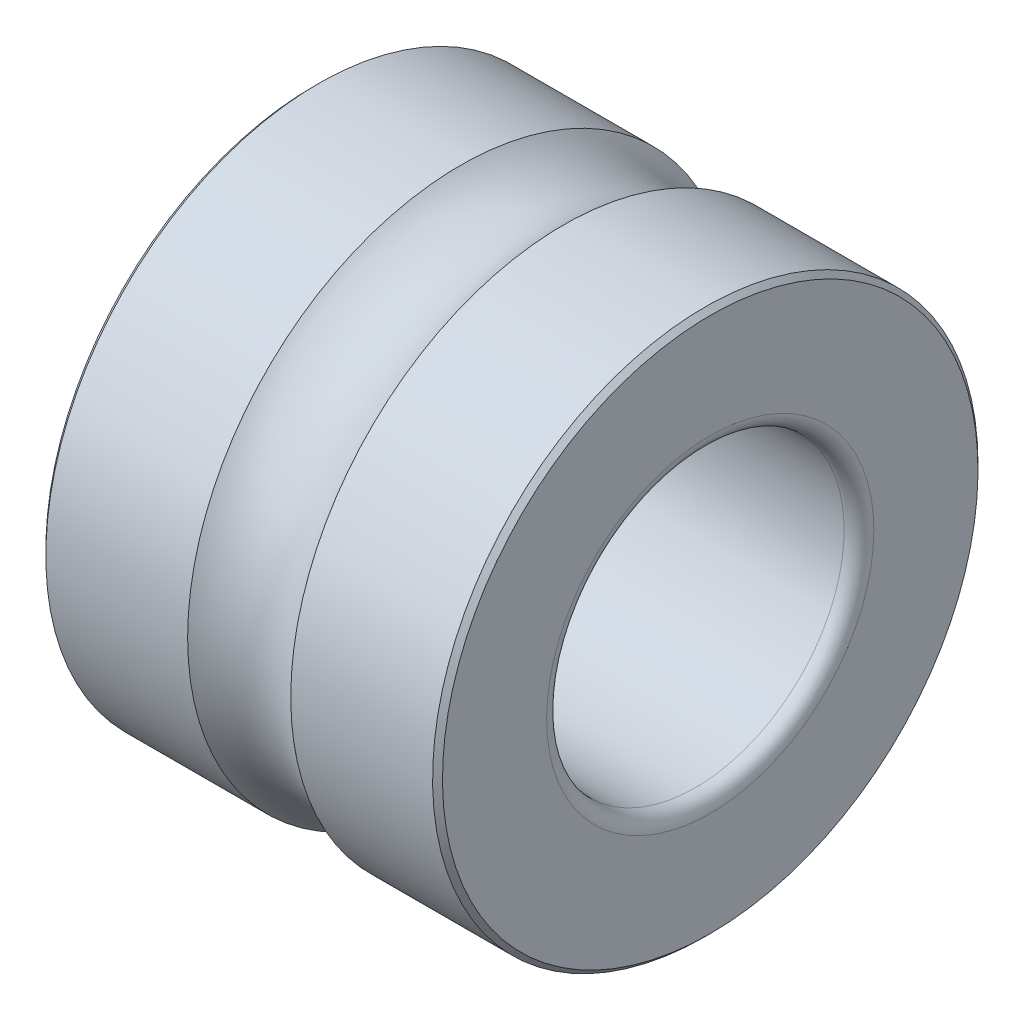
ISO-10303-21;
HEADER;
FILE_DESCRIPTION(('STEP AP214'),'2;1');
FILE_NAME('part.step','',(''),(''),'','','');
FILE_SCHEMA(('AUTOMOTIVE_DESIGN { 1 0 10303 214 1 1 1 1 }'));
ENDSEC;
DATA;
#1=APPLICATION_CONTEXT('core data for automotive mechanical design processes');
#2=APPLICATION_PROTOCOL_DEFINITION('international standard','automotive_design',2000,#1);
#3=PRODUCT_CONTEXT('',#1,'mechanical');
#4=PRODUCT('Part','Part','',(#3));
#5=PRODUCT_RELATED_PRODUCT_CATEGORY('part','',(#4));
#6=PRODUCT_DEFINITION_FORMATION('','',#4);
#7=PRODUCT_DEFINITION_CONTEXT('part definition',#1,'design');
#8=PRODUCT_DEFINITION('design','',#6,#7);
#9=PRODUCT_DEFINITION_SHAPE('','',#8);
#10=(LENGTH_UNIT() NAMED_UNIT(*) SI_UNIT(.MILLI.,.METRE.));
#11=(NAMED_UNIT(*) PLANE_ANGLE_UNIT() SI_UNIT($,.RADIAN.));
#12=(NAMED_UNIT(*) SI_UNIT($,.STERADIAN.) SOLID_ANGLE_UNIT());
#13=UNCERTAINTY_MEASURE_WITH_UNIT(LENGTH_MEASURE(1.E-05),#10,'distance_accuracy_value','');
#14=(GEOMETRIC_REPRESENTATION_CONTEXT(3) GLOBAL_UNCERTAINTY_ASSIGNED_CONTEXT((#13)) GLOBAL_UNIT_ASSIGNED_CONTEXT((#10,
#11,#12)) REPRESENTATION_CONTEXT('',''));
#15=CARTESIAN_POINT('',(0.,0.,0.));
#16=DIRECTION('',(0.,0.,1.));
#17=DIRECTION('',(1.,0.,0.));
#18=AXIS2_PLACEMENT_3D('',#15,#16,#17);
#19=CARTESIAN_POINT('',(-2.,0.,0.));
#20=DIRECTION('',(1.,0.,0.));
#21=DIRECTION('',(0.,0.,-1.));
#22=AXIS2_PLACEMENT_3D('',#19,#20,#21);
#23=CYLINDRICAL_SURFACE('',#22,1.5);
#24=CARTESIAN_POINT('',(-1.85,0.,0.));
#25=DIRECTION('',(-1.,0.,0.));
#26=DIRECTION('',(0.,0.,1.));
#27=AXIS2_PLACEMENT_3D('',#24,#25,#26);
#28=CIRCLE('',#27,1.5);
#29=CARTESIAN_POINT('',(-1.85,0.,1.5));
#30=VERTEX_POINT('',#29);
#31=EDGE_CURVE('E80',#30,#30,#28,.F.);
#32=ORIENTED_EDGE('',*,*,#31,.F.);
#33=EDGE_LOOP('',(#32));
#34=FACE_BOUND('',#33,.T.);
#35=CARTESIAN_POINT('',(1.85,0.,0.));
#36=DIRECTION('',(-1.,0.,0.));
#37=DIRECTION('',(0.,0.,1.));
#38=AXIS2_PLACEMENT_3D('',#35,#36,#37);
#39=CIRCLE('',#38,1.5);
#40=CARTESIAN_POINT('',(1.85,0.,1.5));
#41=VERTEX_POINT('',#40);
#42=EDGE_CURVE('E76',#41,#41,#39,.T.);
#43=ORIENTED_EDGE('',*,*,#42,.F.);
#44=EDGE_LOOP('',(#43));
#45=FACE_BOUND('',#44,.T.);
#46=ADVANCED_FACE('F14',(#34,#45),#23,.F.);
#47=CARTESIAN_POINT('',(-1.85,0.,0.));
#48=DIRECTION('',(-1.,0.,0.));
#49=DIRECTION('',(0.,0.,1.));
#50=AXIS2_PLACEMENT_3D('',#47,#48,#49);
#51=TOROIDAL_SURFACE('',#50,1.65,0.15);
#52=ORIENTED_EDGE('',*,*,#31,.T.);
#53=EDGE_LOOP('',(#52));
#54=FACE_BOUND('',#53,.T.);
#55=CARTESIAN_POINT('',(-2.,0.,0.));
#56=DIRECTION('',(-1.,0.,0.));
#57=DIRECTION('',(0.,0.,-1.));
#58=AXIS2_PLACEMENT_3D('',#55,#56,#57);
#59=CIRCLE('',#58,1.65);
#60=CARTESIAN_POINT('',(-2.,0.,-1.65));
#61=VERTEX_POINT('',#60);
#62=EDGE_CURVE('E79',#61,#61,#59,.T.);
#63=ORIENTED_EDGE('',*,*,#62,.T.);
#64=EDGE_LOOP('',(#63));
#65=FACE_BOUND('',#64,.T.);
#66=ADVANCED_FACE('F94',(#54,#65),#51,.T.);
#67=CARTESIAN_POINT('',(1.85,0.,0.));
#68=DIRECTION('',(-1.,0.,0.));
#69=DIRECTION('',(0.,0.,1.));
#70=AXIS2_PLACEMENT_3D('',#67,#68,#69);
#71=TOROIDAL_SURFACE('',#70,1.65,0.15);
#72=CARTESIAN_POINT('',(2.,0.,0.));
#73=DIRECTION('',(1.,0.,0.));
#74=DIRECTION('',(0.,0.,1.));
#75=AXIS2_PLACEMENT_3D('',#72,#73,#74);
#76=CIRCLE('',#75,1.65);
#77=CARTESIAN_POINT('',(2.,0.,1.65));
#78=VERTEX_POINT('',#77);
#79=EDGE_CURVE('E35',#78,#78,#76,.T.);
#80=ORIENTED_EDGE('',*,*,#79,.T.);
#81=EDGE_LOOP('',(#80));
#82=FACE_BOUND('',#81,.T.);
#83=ORIENTED_EDGE('',*,*,#42,.T.);
#84=EDGE_LOOP('',(#83));
#85=FACE_BOUND('',#84,.T.);
#86=ADVANCED_FACE('F57',(#82,#85),#71,.T.);
#87=CARTESIAN_POINT('',(-2.,1.65,0.));
#88=DIRECTION('',(1.,0.,0.));
#89=DIRECTION('',(0.,0.,-1.));
#90=AXIS2_PLACEMENT_3D('',#87,#88,#89);
#91=PLANE('',#90);
#92=ORIENTED_EDGE('',*,*,#62,.F.);
#93=EDGE_LOOP('',(#92));
#94=FACE_BOUND('',#93,.T.);
#95=CARTESIAN_POINT('',(-1.99999999995271,0.,0.));
#96=DIRECTION('',(1.,0.,0.));
#97=DIRECTION('',(0.,0.,-1.));
#98=AXIS2_PLACEMENT_3D('',#95,#96,#97);
#99=CIRCLE('',#98,2.70000000006121);
#100=CARTESIAN_POINT('',(-1.99999999995271,0.,-2.70000000006121));
#101=VERTEX_POINT('',#100);
#102=EDGE_CURVE('E17',#101,#101,#99,.T.);
#103=ORIENTED_EDGE('',*,*,#102,.F.);
#104=EDGE_LOOP('',(#103));
#105=FACE_BOUND('',#104,.T.);
#106=ADVANCED_FACE('F52',(#94,#105),#91,.F.);
#107=CARTESIAN_POINT('',(2.,2.7,0.));
#108=DIRECTION('',(-1.,0.,0.));
#109=DIRECTION('',(0.,0.,1.));
#110=AXIS2_PLACEMENT_3D('',#107,#108,#109);
#111=PLANE('',#110);
#112=ORIENTED_EDGE('',*,*,#79,.F.);
#113=EDGE_LOOP('',(#112));
#114=FACE_BOUND('',#113,.T.);
#115=CARTESIAN_POINT('',(2.00000000006639,0.,0.));
#116=DIRECTION('',(-1.,0.,0.));
#117=DIRECTION('',(0.,-1.,0.));
#118=AXIS2_PLACEMENT_3D('',#115,#116,#117);
#119=CIRCLE('',#118,2.70000000000437);
#120=CARTESIAN_POINT('',(2.00000000006639,-2.70000000000437,0.));
#121=VERTEX_POINT('',#120);
#122=EDGE_CURVE('E73',#121,#121,#119,.T.);
#123=ORIENTED_EDGE('',*,*,#122,.F.);
#124=EDGE_LOOP('',(#123));
#125=FACE_BOUND('',#124,.T.);
#126=ADVANCED_FACE('F41',(#114,#125),#111,.F.);
#127=CARTESIAN_POINT('',(-1.9500000000221,0.,0.));
#128=DIRECTION('',(1.,0.,0.));
#129=DIRECTION('',(0.,0.,-1.));
#130=AXIS2_PLACEMENT_3D('',#127,#128,#129);
#131=CONICAL_SURFACE('',#130,2.74999999999181,0.785398163397448);
#132=CARTESIAN_POINT('',(-1.95,0.,0.));
#133=DIRECTION('',(1.,0.,0.));
#134=DIRECTION('',(0.,0.,-1.));
#135=AXIS2_PLACEMENT_3D('',#132,#133,#134);
#136=CIRCLE('',#135,2.75);
#137=CARTESIAN_POINT('',(-1.95,0.,-2.75));
#138=VERTEX_POINT('',#137);
#139=EDGE_CURVE('E66',#138,#138,#136,.T.);
#140=ORIENTED_EDGE('',*,*,#139,.F.);
#141=EDGE_LOOP('',(#140));
#142=FACE_BOUND('',#141,.T.);
#143=ORIENTED_EDGE('',*,*,#102,.T.);
#144=EDGE_LOOP('',(#143));
#145=FACE_BOUND('',#144,.T.);
#146=ADVANCED_FACE('F51',(#142,#145),#131,.T.);
#147=CARTESIAN_POINT('',(1.94999999990841,0.,0.));
#148=DIRECTION('',(-1.,0.,0.));
#149=DIRECTION('',(0.,-1.,0.));
#150=AXIS2_PLACEMENT_3D('',#147,#148,#149);
#151=CONICAL_SURFACE('',#150,2.7500000001055,0.785398162829014);
#152=ORIENTED_EDGE('',*,*,#122,.T.);
#153=EDGE_LOOP('',(#152));
#154=FACE_BOUND('',#153,.T.);
#155=CARTESIAN_POINT('',(1.95,0.,0.));
#156=DIRECTION('',(1.,0.,0.));
#157=DIRECTION('',(0.,0.,-1.));
#158=AXIS2_PLACEMENT_3D('',#155,#156,#157);
#159=CIRCLE('',#158,2.75);
#160=CARTESIAN_POINT('',(1.95,0.,-2.75));
#161=VERTEX_POINT('',#160);
#162=EDGE_CURVE('E26',#161,#161,#159,.F.);
#163=ORIENTED_EDGE('',*,*,#162,.F.);
#164=EDGE_LOOP('',(#163));
#165=FACE_BOUND('',#164,.T.);
#166=ADVANCED_FACE('F116',(#154,#165),#151,.T.);
#167=CARTESIAN_POINT('',(-2.,0.,0.));
#168=DIRECTION('',(1.,0.,0.));
#169=DIRECTION('',(0.,0.,-1.));
#170=AXIS2_PLACEMENT_3D('',#167,#168,#169);
#171=CYLINDRICAL_SURFACE('',#170,2.75);
#172=ORIENTED_EDGE('',*,*,#139,.T.);
#173=EDGE_LOOP('',(#172));
#174=FACE_BOUND('',#173,.T.);
#175=CARTESIAN_POINT('',(-0.520034614232552,0.,0.));
#176=DIRECTION('',(-1.,0.,0.));
#177=DIRECTION('',(0.,0.,1.));
#178=AXIS2_PLACEMENT_3D('',#175,#176,#177);
#179=CIRCLE('',#178,2.75);
#180=CARTESIAN_POINT('',(-0.520034614232552,0.,2.75));
#181=VERTEX_POINT('',#180);
#182=EDGE_CURVE('E21',#181,#181,#179,.T.);
#183=ORIENTED_EDGE('',*,*,#182,.T.);
#184=EDGE_LOOP('',(#183));
#185=FACE_BOUND('',#184,.T.);
#186=ADVANCED_FACE('F122',(#174,#185),#171,.T.);
#187=CARTESIAN_POINT('',(-2.,0.,0.));
#188=DIRECTION('',(1.,0.,0.));
#189=DIRECTION('',(0.,0.,-1.));
#190=AXIS2_PLACEMENT_3D('',#187,#188,#189);
#191=CYLINDRICAL_SURFACE('',#190,2.75);
#192=ORIENTED_EDGE('',*,*,#162,.T.);
#193=EDGE_LOOP('',(#192));
#194=FACE_BOUND('',#193,.T.);
#195=CARTESIAN_POINT('',(0.520034614232552,0.,0.));
#196=DIRECTION('',(-1.,0.,0.));
#197=DIRECTION('',(0.,0.,1.));
#198=AXIS2_PLACEMENT_3D('',#195,#196,#197);
#199=CIRCLE('',#198,2.75);
#200=CARTESIAN_POINT('',(0.520034614232552,0.,2.75));
#201=VERTEX_POINT('',#200);
#202=EDGE_CURVE('E9',#201,#201,#199,.F.);
#203=ORIENTED_EDGE('',*,*,#202,.T.);
#204=EDGE_LOOP('',(#203));
#205=FACE_BOUND('',#204,.T.);
#206=ADVANCED_FACE('F126',(#194,#205),#191,.T.);
#207=CARTESIAN_POINT('',(0.,0.,0.));
#208=DIRECTION('',(-1.,0.,0.));
#209=DIRECTION('',(0.,0.,1.));
#210=AXIS2_PLACEMENT_3D('',#207,#208,#209);
#211=TOROIDAL_SURFACE('',#210,3.35,0.794);
#212=ORIENTED_EDGE('',*,*,#202,.F.);
#213=EDGE_LOOP('',(#212));
#214=FACE_BOUND('',#213,.T.);
#215=ORIENTED_EDGE('',*,*,#182,.F.);
#216=EDGE_LOOP('',(#215));
#217=FACE_BOUND('',#216,.T.);
#218=ADVANCED_FACE('F124',(#214,#217),#211,.F.);
#219=CLOSED_SHELL('',(#46,#66,#86,#106,#126,#146,#166,#186,#206,#218));
#220=MANIFOLD_SOLID_BREP('B1',#219);
#221=ADVANCED_BREP_SHAPE_REPRESENTATION('',(#18,#220),#14);
#222=SHAPE_DEFINITION_REPRESENTATION(#9,#221);
ENDSEC;
END-ISO-10303-21;
